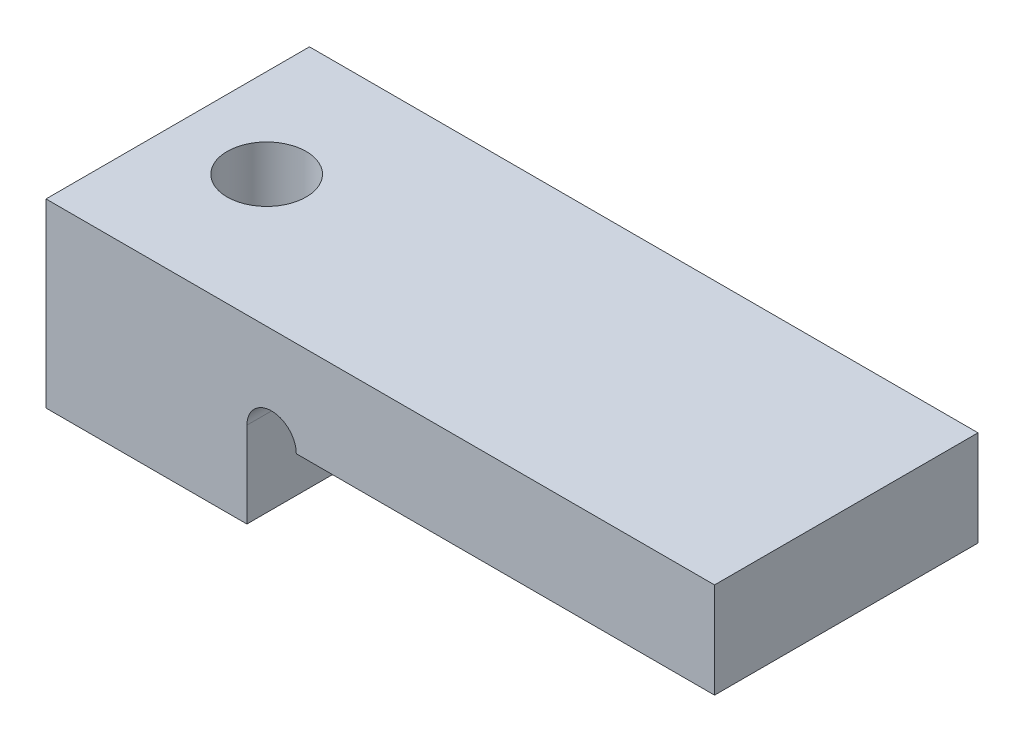
ISO-10303-21;
HEADER;
FILE_DESCRIPTION(('STEP AP214'),'2;1');
FILE_NAME('part.step','',(''),(''),'','','');
FILE_SCHEMA(('AUTOMOTIVE_DESIGN { 1 0 10303 214 1 1 1 1 }'));
ENDSEC;
DATA;
#1=APPLICATION_CONTEXT('core data for automotive mechanical design processes');
#2=APPLICATION_PROTOCOL_DEFINITION('international standard','automotive_design',2000,#1);
#3=PRODUCT_CONTEXT('',#1,'mechanical');
#4=PRODUCT('Part','Part','',(#3));
#5=PRODUCT_RELATED_PRODUCT_CATEGORY('part','',(#4));
#6=PRODUCT_DEFINITION_FORMATION('','',#4);
#7=PRODUCT_DEFINITION_CONTEXT('part definition',#1,'design');
#8=PRODUCT_DEFINITION('design','',#6,#7);
#9=PRODUCT_DEFINITION_SHAPE('','',#8);
#10=(LENGTH_UNIT() NAMED_UNIT(*) SI_UNIT(.MILLI.,.METRE.));
#11=(NAMED_UNIT(*) PLANE_ANGLE_UNIT() SI_UNIT($,.RADIAN.));
#12=(NAMED_UNIT(*) SI_UNIT($,.STERADIAN.) SOLID_ANGLE_UNIT());
#13=UNCERTAINTY_MEASURE_WITH_UNIT(LENGTH_MEASURE(1.E-05),#10,'distance_accuracy_value','');
#14=(GEOMETRIC_REPRESENTATION_CONTEXT(3) GLOBAL_UNCERTAINTY_ASSIGNED_CONTEXT((#13)) GLOBAL_UNIT_ASSIGNED_CONTEXT((#10,
#11,#12)) REPRESENTATION_CONTEXT('',''));
#15=CARTESIAN_POINT('',(0.,0.,0.));
#16=DIRECTION('',(0.,0.,1.));
#17=DIRECTION('',(1.,0.,0.));
#18=AXIS2_PLACEMENT_3D('',#15,#16,#17);
#19=CARTESIAN_POINT('',(20.3,5.5,4.));
#20=DIRECTION('',(-1.,0.,0.));
#21=DIRECTION('',(0.,0.,1.));
#22=AXIS2_PLACEMENT_3D('',#19,#20,#21);
#23=PLANE('',#22);
#24=DIRECTION('',(0.,1.,0.));
#25=VECTOR('',#24,1.);
#26=CARTESIAN_POINT('',(20.3,5.5,-4.));
#27=LINE('',#26,#25);
#28=CARTESIAN_POINT('',(20.3,2.6,-4.));
#29=VERTEX_POINT('',#28);
#30=CARTESIAN_POINT('',(20.3,5.5,-4.));
#31=VERTEX_POINT('',#30);
#32=EDGE_CURVE('E125',#29,#31,#27,.T.);
#33=ORIENTED_EDGE('',*,*,#32,.T.);
#34=DIRECTION('',(0.,0.,-1.));
#35=VECTOR('',#34,1.);
#36=CARTESIAN_POINT('',(20.3,5.5,4.));
#37=LINE('',#36,#35);
#38=CARTESIAN_POINT('',(20.3,5.5,4.));
#39=VERTEX_POINT('',#38);
#40=EDGE_CURVE('E11',#39,#31,#37,.T.);
#41=ORIENTED_EDGE('',*,*,#40,.F.);
#42=DIRECTION('',(0.,1.,0.));
#43=VECTOR('',#42,1.);
#44=CARTESIAN_POINT('',(20.3,5.5,4.));
#45=LINE('',#44,#43);
#46=CARTESIAN_POINT('',(20.3,2.6,4.));
#47=VERTEX_POINT('',#46);
#48=EDGE_CURVE('E137',#47,#39,#45,.T.);
#49=ORIENTED_EDGE('',*,*,#48,.F.);
#50=DIRECTION('',(0.,0.,-1.));
#51=VECTOR('',#50,1.);
#52=CARTESIAN_POINT('',(20.3,2.6,4.));
#53=LINE('',#52,#51);
#54=EDGE_CURVE('E124',#47,#29,#53,.T.);
#55=ORIENTED_EDGE('',*,*,#54,.T.);
#56=EDGE_LOOP('',(#33,#41,#49,#55));
#57=FACE_BOUND('',#56,.T.);
#58=ADVANCED_FACE('F33',(#57),#23,.F.);
#59=CARTESIAN_POINT('',(20.3,5.5,4.));
#60=DIRECTION('',(0.,-1.,0.));
#61=DIRECTION('',(1.,0.,0.));
#62=AXIS2_PLACEMENT_3D('',#59,#60,#61);
#63=PLANE('',#62);
#64=CARTESIAN_POINT('',(2.7,5.5,0.));
#65=DIRECTION('',(0.,1.,0.));
#66=DIRECTION('',(0.,0.,1.));
#67=AXIS2_PLACEMENT_3D('',#64,#65,#66);
#68=CIRCLE('',#67,1.2);
#69=CARTESIAN_POINT('',(2.7,5.5,1.2));
#70=VERTEX_POINT('',#69);
#71=EDGE_CURVE('E157',#70,#70,#68,.T.);
#72=ORIENTED_EDGE('',*,*,#71,.F.);
#73=EDGE_LOOP('',(#72));
#74=FACE_BOUND('',#73,.T.);
#75=DIRECTION('',(-1.,0.,0.));
#76=VECTOR('',#75,1.);
#77=CARTESIAN_POINT('',(20.3,5.5,-4.));
#78=LINE('',#77,#76);
#79=CARTESIAN_POINT('',(0.,5.5,-4.));
#80=VERTEX_POINT('',#79);
#81=EDGE_CURVE('E128',#31,#80,#78,.T.);
#82=ORIENTED_EDGE('',*,*,#81,.T.);
#83=DIRECTION('',(0.,0.,-1.));
#84=VECTOR('',#83,1.);
#85=CARTESIAN_POINT('',(0.,5.5,4.));
#86=LINE('',#85,#84);
#87=CARTESIAN_POINT('',(0.,5.5,4.));
#88=VERTEX_POINT('',#87);
#89=EDGE_CURVE('E42',#88,#80,#86,.T.);
#90=ORIENTED_EDGE('',*,*,#89,.F.);
#91=DIRECTION('',(-1.,0.,0.));
#92=VECTOR('',#91,1.);
#93=CARTESIAN_POINT('',(20.3,5.5,4.));
#94=LINE('',#93,#92);
#95=EDGE_CURVE('E90',#39,#88,#94,.T.);
#96=ORIENTED_EDGE('',*,*,#95,.F.);
#97=ORIENTED_EDGE('',*,*,#40,.T.);
#98=EDGE_LOOP('',(#82,#90,#96,#97));
#99=FACE_BOUND('',#98,.T.);
#100=ADVANCED_FACE('F183',(#74,#99),#63,.F.);
#101=CARTESIAN_POINT('',(0.,0.,4.));
#102=DIRECTION('',(1.,0.,0.));
#103=DIRECTION('',(0.,0.,-1.));
#104=AXIS2_PLACEMENT_3D('',#101,#102,#103);
#105=PLANE('',#104);
#106=DIRECTION('',(0.,-1.,0.));
#107=VECTOR('',#106,1.);
#108=CARTESIAN_POINT('',(0.,0.,-4.));
#109=LINE('',#108,#107);
#110=CARTESIAN_POINT('',(0.,0.,-4.));
#111=VERTEX_POINT('',#110);
#112=EDGE_CURVE('E110',#80,#111,#109,.T.);
#113=ORIENTED_EDGE('',*,*,#112,.T.);
#114=DIRECTION('',(0.,0.,-1.));
#115=VECTOR('',#114,1.);
#116=CARTESIAN_POINT('',(0.,0.,4.));
#117=LINE('',#116,#115);
#118=CARTESIAN_POINT('',(0.,0.,4.));
#119=VERTEX_POINT('',#118);
#120=EDGE_CURVE('E107',#119,#111,#117,.T.);
#121=ORIENTED_EDGE('',*,*,#120,.F.);
#122=DIRECTION('',(0.,-1.,0.));
#123=VECTOR('',#122,1.);
#124=CARTESIAN_POINT('',(0.,0.,4.));
#125=LINE('',#124,#123);
#126=EDGE_CURVE('E96',#88,#119,#125,.T.);
#127=ORIENTED_EDGE('',*,*,#126,.F.);
#128=ORIENTED_EDGE('',*,*,#89,.T.);
#129=EDGE_LOOP('',(#113,#121,#127,#128));
#130=FACE_BOUND('',#129,.T.);
#131=ADVANCED_FACE('F108',(#130),#105,.F.);
#132=CARTESIAN_POINT('',(0.,0.,4.));
#133=DIRECTION('',(0.,1.,0.));
#134=DIRECTION('',(-1.,0.,0.));
#135=AXIS2_PLACEMENT_3D('',#132,#133,#134);
#136=PLANE('',#135);
#137=CARTESIAN_POINT('',(2.7,0.,0.));
#138=DIRECTION('',(0.,1.,0.));
#139=DIRECTION('',(-1.,0.,0.));
#140=AXIS2_PLACEMENT_3D('',#137,#138,#139);
#141=CIRCLE('',#140,1.2);
#142=CARTESIAN_POINT('',(1.5,0.,0.));
#143=VERTEX_POINT('',#142);
#144=EDGE_CURVE('E36',#143,#143,#141,.T.);
#145=ORIENTED_EDGE('',*,*,#144,.T.);
#146=EDGE_LOOP('',(#145));
#147=FACE_BOUND('',#146,.T.);
#148=DIRECTION('',(1.,0.,0.));
#149=VECTOR('',#148,1.);
#150=CARTESIAN_POINT('',(0.,0.,-4.));
#151=LINE('',#150,#149);
#152=CARTESIAN_POINT('',(6.1,0.,-4.));
#153=VERTEX_POINT('',#152);
#154=EDGE_CURVE('E131',#111,#153,#151,.T.);
#155=ORIENTED_EDGE('',*,*,#154,.T.);
#156=DIRECTION('',(0.,0.,-1.));
#157=VECTOR('',#156,1.);
#158=CARTESIAN_POINT('',(6.1,0.,4.));
#159=LINE('',#158,#157);
#160=CARTESIAN_POINT('',(6.1,0.,4.));
#161=VERTEX_POINT('',#160);
#162=EDGE_CURVE('E113',#161,#153,#159,.T.);
#163=ORIENTED_EDGE('',*,*,#162,.F.);
#164=DIRECTION('',(1.,0.,0.));
#165=VECTOR('',#164,1.);
#166=CARTESIAN_POINT('',(0.,0.,4.));
#167=LINE('',#166,#165);
#168=EDGE_CURVE('E101',#119,#161,#167,.T.);
#169=ORIENTED_EDGE('',*,*,#168,.F.);
#170=ORIENTED_EDGE('',*,*,#120,.T.);
#171=EDGE_LOOP('',(#155,#163,#169,#170));
#172=FACE_BOUND('',#171,.T.);
#173=ADVANCED_FACE('F115',(#147,#172),#136,.F.);
#174=CARTESIAN_POINT('',(6.1,2.6,4.));
#175=DIRECTION('',(-1.,0.,0.));
#176=DIRECTION('',(0.,-1.,0.));
#177=AXIS2_PLACEMENT_3D('',#174,#175,#176);
#178=PLANE('',#177);
#179=DIRECTION('',(0.,1.,0.));
#180=VECTOR('',#179,1.);
#181=CARTESIAN_POINT('',(6.1,2.6,-4.));
#182=LINE('',#181,#180);
#183=CARTESIAN_POINT('',(6.1,2.6,-4.));
#184=VERTEX_POINT('',#183);
#185=EDGE_CURVE('E133',#153,#184,#182,.T.);
#186=ORIENTED_EDGE('',*,*,#185,.T.);
#187=DIRECTION('',(0.,0.,-1.));
#188=VECTOR('',#187,1.);
#189=CARTESIAN_POINT('',(6.1,2.6,4.));
#190=LINE('',#189,#188);
#191=CARTESIAN_POINT('',(6.1,2.6,4.));
#192=VERTEX_POINT('',#191);
#193=EDGE_CURVE('E75',#192,#184,#190,.T.);
#194=ORIENTED_EDGE('',*,*,#193,.F.);
#195=DIRECTION('',(0.,1.,0.));
#196=VECTOR('',#195,1.);
#197=CARTESIAN_POINT('',(6.1,2.6,4.));
#198=LINE('',#197,#196);
#199=EDGE_CURVE('E118',#161,#192,#198,.T.);
#200=ORIENTED_EDGE('',*,*,#199,.F.);
#201=ORIENTED_EDGE('',*,*,#162,.T.);
#202=EDGE_LOOP('',(#186,#194,#200,#201));
#203=FACE_BOUND('',#202,.T.);
#204=ADVANCED_FACE('F146',(#203),#178,.F.);
#205=CARTESIAN_POINT('',(6.1,2.6,4.));
#206=DIRECTION('',(0.,1.,0.));
#207=DIRECTION('',(-1.,0.,0.));
#208=AXIS2_PLACEMENT_3D('',#205,#206,#207);
#209=PLANE('',#208);
#210=DIRECTION('',(1.,0.,0.));
#211=VECTOR('',#210,1.);
#212=CARTESIAN_POINT('',(6.1,2.6,4.));
#213=LINE('',#212,#211);
#214=CARTESIAN_POINT('',(7.6,2.6,4.));
#215=VERTEX_POINT('',#214);
#216=EDGE_CURVE('E50',#215,#47,#213,.T.);
#217=ORIENTED_EDGE('',*,*,#216,.F.);
#218=DIRECTION('',(0.,0.,1.));
#219=VECTOR('',#218,1.);
#220=CARTESIAN_POINT('',(7.6,2.6,-4.));
#221=LINE('',#220,#219);
#222=CARTESIAN_POINT('',(7.6,2.6,-4.));
#223=VERTEX_POINT('',#222);
#224=EDGE_CURVE('E151',#215,#223,#221,.F.);
#225=ORIENTED_EDGE('',*,*,#224,.T.);
#226=DIRECTION('',(1.,0.,0.));
#227=VECTOR('',#226,1.);
#228=CARTESIAN_POINT('',(6.1,2.6,-4.));
#229=LINE('',#228,#227);
#230=EDGE_CURVE('E82',#223,#29,#229,.T.);
#231=ORIENTED_EDGE('',*,*,#230,.T.);
#232=ORIENTED_EDGE('',*,*,#54,.F.);
#233=EDGE_LOOP('',(#217,#225,#231,#232));
#234=FACE_BOUND('',#233,.T.);
#235=ADVANCED_FACE('F156',(#234),#209,.F.);
#236=CARTESIAN_POINT('',(0.,0.,4.));
#237=DIRECTION('',(0.,0.,1.));
#238=DIRECTION('',(1.,0.,0.));
#239=AXIS2_PLACEMENT_3D('',#236,#237,#238);
#240=PLANE('',#239);
#241=CARTESIAN_POINT('',(6.85,2.6,4.));
#242=DIRECTION('',(0.,0.,1.));
#243=DIRECTION('',(1.,0.,0.));
#244=AXIS2_PLACEMENT_3D('',#241,#242,#243);
#245=CIRCLE('',#244,0.75);
#246=EDGE_CURVE('E148',#215,#192,#245,.T.);
#247=ORIENTED_EDGE('',*,*,#246,.F.);
#248=ORIENTED_EDGE('',*,*,#216,.T.);
#249=ORIENTED_EDGE('',*,*,#48,.T.);
#250=ORIENTED_EDGE('',*,*,#95,.T.);
#251=ORIENTED_EDGE('',*,*,#126,.T.);
#252=ORIENTED_EDGE('',*,*,#168,.T.);
#253=ORIENTED_EDGE('',*,*,#199,.T.);
#254=EDGE_LOOP('',(#247,#248,#249,#250,#251,#252,#253));
#255=FACE_BOUND('',#254,.T.);
#256=ADVANCED_FACE('F98',(#255),#240,.T.);
#257=CARTESIAN_POINT('',(0.,0.,-4.));
#258=DIRECTION('',(0.,0.,1.));
#259=DIRECTION('',(1.,0.,0.));
#260=AXIS2_PLACEMENT_3D('',#257,#258,#259);
#261=PLANE('',#260);
#262=ORIENTED_EDGE('',*,*,#230,.F.);
#263=CARTESIAN_POINT('',(6.85,2.6,-4.));
#264=DIRECTION('',(0.,0.,1.));
#265=DIRECTION('',(1.,0.,0.));
#266=AXIS2_PLACEMENT_3D('',#263,#264,#265);
#267=CIRCLE('',#266,0.75);
#268=EDGE_CURVE('E153',#223,#184,#267,.T.);
#269=ORIENTED_EDGE('',*,*,#268,.T.);
#270=ORIENTED_EDGE('',*,*,#185,.F.);
#271=ORIENTED_EDGE('',*,*,#154,.F.);
#272=ORIENTED_EDGE('',*,*,#112,.F.);
#273=ORIENTED_EDGE('',*,*,#81,.F.);
#274=ORIENTED_EDGE('',*,*,#32,.F.);
#275=EDGE_LOOP('',(#262,#269,#270,#271,#272,#273,#274));
#276=FACE_BOUND('',#275,.T.);
#277=ADVANCED_FACE('F142',(#276),#261,.F.);
#278=CARTESIAN_POINT('',(2.7,-1.2E-05,0.));
#279=DIRECTION('',(0.,1.,0.));
#280=DIRECTION('',(0.,0.,1.));
#281=AXIS2_PLACEMENT_3D('',#278,#279,#280);
#282=CYLINDRICAL_SURFACE('',#281,1.2);
#283=ORIENTED_EDGE('',*,*,#71,.T.);
#284=EDGE_LOOP('',(#283));
#285=FACE_BOUND('',#284,.T.);
#286=ORIENTED_EDGE('',*,*,#144,.F.);
#287=EDGE_LOOP('',(#286));
#288=FACE_BOUND('',#287,.T.);
#289=ADVANCED_FACE('F172',(#285,#288),#282,.F.);
#290=CARTESIAN_POINT('',(6.85,2.6,-4.));
#291=DIRECTION('',(0.,0.,1.));
#292=DIRECTION('',(1.,0.,0.));
#293=AXIS2_PLACEMENT_3D('',#290,#291,#292);
#294=CYLINDRICAL_SURFACE('',#293,0.75);
#295=ORIENTED_EDGE('',*,*,#268,.F.);
#296=ORIENTED_EDGE('',*,*,#224,.F.);
#297=ORIENTED_EDGE('',*,*,#246,.T.);
#298=ORIENTED_EDGE('',*,*,#193,.T.);
#299=EDGE_LOOP('',(#295,#296,#297,#298));
#300=FACE_BOUND('',#299,.T.);
#301=ADVANCED_FACE('F154',(#300),#294,.F.);
#302=CLOSED_SHELL('',(#58,#100,#131,#173,#204,#235,#256,#277,#289,#301));
#303=MANIFOLD_SOLID_BREP('B2',#302);
#304=ADVANCED_BREP_SHAPE_REPRESENTATION('',(#18,#303),#14);
#305=SHAPE_DEFINITION_REPRESENTATION(#9,#304);
ENDSEC;
END-ISO-10303-21;
